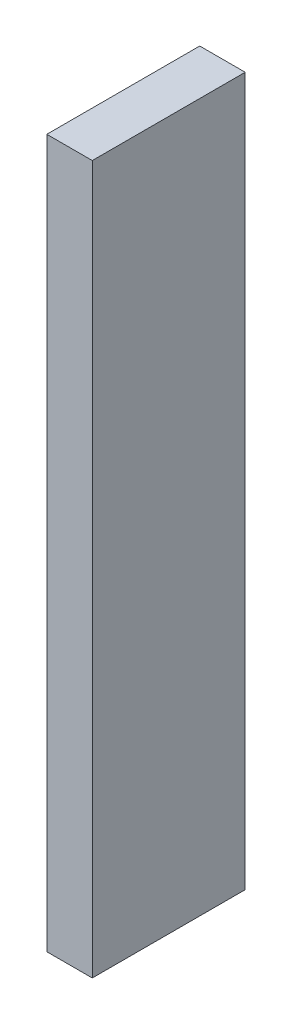
ISO-10303-21;
HEADER;
FILE_DESCRIPTION(('STEP AP214'),'2;1');
FILE_NAME('part.step','',(''),(''),'','','');
FILE_SCHEMA(('AUTOMOTIVE_DESIGN { 1 0 10303 214 1 1 1 1 }'));
ENDSEC;
DATA;
#1=APPLICATION_CONTEXT('core data for automotive mechanical design processes');
#2=APPLICATION_PROTOCOL_DEFINITION('international standard','automotive_design',2000,#1);
#3=PRODUCT_CONTEXT('',#1,'mechanical');
#4=PRODUCT('Part','Part','',(#3));
#5=PRODUCT_RELATED_PRODUCT_CATEGORY('part','',(#4));
#6=PRODUCT_DEFINITION_FORMATION('','',#4);
#7=PRODUCT_DEFINITION_CONTEXT('part definition',#1,'design');
#8=PRODUCT_DEFINITION('design','',#6,#7);
#9=PRODUCT_DEFINITION_SHAPE('','',#8);
#10=(LENGTH_UNIT() NAMED_UNIT(*) SI_UNIT(.MILLI.,.METRE.));
#11=(NAMED_UNIT(*) PLANE_ANGLE_UNIT() SI_UNIT($,.RADIAN.));
#12=(NAMED_UNIT(*) SI_UNIT($,.STERADIAN.) SOLID_ANGLE_UNIT());
#13=UNCERTAINTY_MEASURE_WITH_UNIT(LENGTH_MEASURE(1.E-05),#10,'distance_accuracy_value','');
#14=(GEOMETRIC_REPRESENTATION_CONTEXT(3) GLOBAL_UNCERTAINTY_ASSIGNED_CONTEXT((#13)) GLOBAL_UNIT_ASSIGNED_CONTEXT((#10,
#11,#12)) REPRESENTATION_CONTEXT('',''));
#15=CARTESIAN_POINT('',(0.,0.,0.));
#16=DIRECTION('',(0.,0.,1.));
#17=DIRECTION('',(1.,0.,0.));
#18=AXIS2_PLACEMENT_3D('',#15,#16,#17);
#19=CARTESIAN_POINT('',(130.275545195554,22.4180708263693,96.0720244776067));
#20=DIRECTION('',(-1.69244514382854E-09,0.,1.));
#21=DIRECTION('',(1.,0.,1.69244514382854E-09));
#22=AXIS2_PLACEMENT_3D('',#19,#20,#21);
#23=PLANE('',#22);
#24=DIRECTION('',(0.,-1.,0.));
#25=VECTOR('',#24,1.);
#26=CARTESIAN_POINT('',(131.258630292567,22.4180708263693,96.0720244792705));
#27=LINE('',#26,#25);
#28=CARTESIAN_POINT('',(131.258630292567,22.4180708263693,96.0720244792705));
#29=VERTEX_POINT('',#28);
#30=CARTESIAN_POINT('',(131.258630292567,7.11212965552236,96.0720244792705));
#31=VERTEX_POINT('',#30);
#32=EDGE_CURVE('E79',#29,#31,#27,.T.);
#33=ORIENTED_EDGE('',*,*,#32,.F.);
#34=DIRECTION('',(1.,0.,1.69244514382854E-09));
#35=VECTOR('',#34,1.);
#36=CARTESIAN_POINT('',(130.275545195554,22.4180708263693,96.0720244776067));
#37=LINE('',#36,#35);
#38=CARTESIAN_POINT('',(130.275545195554,22.4180708263693,96.0720244776067));
#39=VERTEX_POINT('',#38);
#40=EDGE_CURVE('E32',#39,#29,#37,.T.);
#41=ORIENTED_EDGE('',*,*,#40,.F.);
#42=DIRECTION('',(0.,-1.,0.));
#43=VECTOR('',#42,1.);
#44=CARTESIAN_POINT('',(130.275545195554,22.4180708263693,96.0720244776067));
#45=LINE('',#44,#43);
#46=CARTESIAN_POINT('',(130.275545195554,7.11212965552236,96.0720244776067));
#47=VERTEX_POINT('',#46);
#48=EDGE_CURVE('E71',#39,#47,#45,.T.);
#49=ORIENTED_EDGE('',*,*,#48,.T.);
#50=DIRECTION('',(1.,0.,1.69244514382854E-09));
#51=VECTOR('',#50,1.);
#52=CARTESIAN_POINT('',(130.275545195554,7.11212965552236,96.0720244776067));
#53=LINE('',#52,#51);
#54=EDGE_CURVE('E10',#47,#31,#53,.T.);
#55=ORIENTED_EDGE('',*,*,#54,.T.);
#56=EDGE_LOOP('',(#33,#41,#49,#55));
#57=FACE_BOUND('',#56,.T.);
#58=ADVANCED_FACE('F16',(#57),#23,.T.);
#59=CARTESIAN_POINT('',(130.275545195554,7.11212965552236,96.0720244776067));
#60=DIRECTION('',(0.,-1.,0.));
#61=DIRECTION('',(0.,0.,-1.));
#62=AXIS2_PLACEMENT_3D('',#59,#60,#61);
#63=PLANE('',#62);
#64=DIRECTION('',(1.69244514382854E-09,0.,-1.));
#65=VECTOR('',#64,1.);
#66=CARTESIAN_POINT('',(131.258630292567,7.11212965552236,96.0720244792705));
#67=LINE('',#66,#65);
#68=CARTESIAN_POINT('',(131.258630298163,7.11212965552235,92.7660833084218));
#69=VERTEX_POINT('',#68);
#70=EDGE_CURVE('E82',#31,#69,#67,.T.);
#71=ORIENTED_EDGE('',*,*,#70,.F.);
#72=ORIENTED_EDGE('',*,*,#54,.F.);
#73=DIRECTION('',(1.69244514382854E-09,0.,-1.));
#74=VECTOR('',#73,1.);
#75=CARTESIAN_POINT('',(130.275545195554,7.11212965552236,96.0720244776067));
#76=LINE('',#75,#74);
#77=CARTESIAN_POINT('',(130.27554520115,7.11212965552235,92.7660833067579));
#78=VERTEX_POINT('',#77);
#79=EDGE_CURVE('E67',#47,#78,#76,.T.);
#80=ORIENTED_EDGE('',*,*,#79,.T.);
#81=DIRECTION('',(1.,0.,1.69244514382854E-09));
#82=VECTOR('',#81,1.);
#83=CARTESIAN_POINT('',(130.27554520115,7.11212965552235,92.7660833067579));
#84=LINE('',#83,#82);
#85=EDGE_CURVE('E24',#78,#69,#84,.T.);
#86=ORIENTED_EDGE('',*,*,#85,.T.);
#87=EDGE_LOOP('',(#71,#72,#80,#86));
#88=FACE_BOUND('',#87,.T.);
#89=ADVANCED_FACE('F68',(#88),#63,.T.);
#90=CARTESIAN_POINT('',(130.27554520115,7.11212965552235,92.7660833067579));
#91=DIRECTION('',(1.69244514382854E-09,0.,-1.));
#92=DIRECTION('',(-1.,0.,-1.69244514382854E-09));
#93=AXIS2_PLACEMENT_3D('',#90,#91,#92);
#94=PLANE('',#93);
#95=DIRECTION('',(0.,1.,0.));
#96=VECTOR('',#95,1.);
#97=CARTESIAN_POINT('',(131.258630298163,7.11212965552235,92.7660833084218));
#98=LINE('',#97,#96);
#99=CARTESIAN_POINT('',(131.258630298163,22.418070826371,92.7660832999612));
#100=VERTEX_POINT('',#99);
#101=EDGE_CURVE('E65',#69,#100,#98,.T.);
#102=ORIENTED_EDGE('',*,*,#101,.F.);
#103=ORIENTED_EDGE('',*,*,#85,.F.);
#104=DIRECTION('',(0.,1.,0.));
#105=VECTOR('',#104,1.);
#106=CARTESIAN_POINT('',(130.27554520115,7.11212965552235,92.7660833067579));
#107=LINE('',#106,#105);
#108=CARTESIAN_POINT('',(130.27554520115,22.418070826371,92.7660832982974));
#109=VERTEX_POINT('',#108);
#110=EDGE_CURVE('E62',#78,#109,#107,.T.);
#111=ORIENTED_EDGE('',*,*,#110,.T.);
#112=DIRECTION('',(1.,0.,1.69244514382854E-09));
#113=VECTOR('',#112,1.);
#114=CARTESIAN_POINT('',(130.27554520115,22.418070826371,92.7660832982974));
#115=LINE('',#114,#113);
#116=EDGE_CURVE('E48',#109,#100,#115,.T.);
#117=ORIENTED_EDGE('',*,*,#116,.T.);
#118=EDGE_LOOP('',(#102,#103,#111,#117));
#119=FACE_BOUND('',#118,.T.);
#120=ADVANCED_FACE('F60',(#119),#94,.T.);
#121=CARTESIAN_POINT('',(130.27554520115,22.418070826371,92.7660832982974));
#122=DIRECTION('',(0.,1.,0.));
#123=DIRECTION('',(-1.,0.,0.));
#124=AXIS2_PLACEMENT_3D('',#121,#122,#123);
#125=PLANE('',#124);
#126=DIRECTION('',(-1.69244514382854E-09,0.,1.));
#127=VECTOR('',#126,1.);
#128=CARTESIAN_POINT('',(131.258630298163,22.418070826371,92.7660832999612));
#129=LINE('',#128,#127);
#130=EDGE_CURVE('E85',#100,#29,#129,.T.);
#131=ORIENTED_EDGE('',*,*,#130,.F.);
#132=ORIENTED_EDGE('',*,*,#116,.F.);
#133=DIRECTION('',(-1.69244514382854E-09,0.,1.));
#134=VECTOR('',#133,1.);
#135=CARTESIAN_POINT('',(130.27554520115,22.418070826371,92.7660832982974));
#136=LINE('',#135,#134);
#137=EDGE_CURVE('E74',#109,#39,#136,.T.);
#138=ORIENTED_EDGE('',*,*,#137,.T.);
#139=ORIENTED_EDGE('',*,*,#40,.T.);
#140=EDGE_LOOP('',(#131,#132,#138,#139));
#141=FACE_BOUND('',#140,.T.);
#142=ADVANCED_FACE('F96',(#141),#125,.T.);
#143=CARTESIAN_POINT('',(130.275545201028,17.2651002409467,92.8378607087388));
#144=DIRECTION('',(1.,0.,1.69244514382854E-09));
#145=DIRECTION('',(0.,1.,0.));
#146=AXIS2_PLACEMENT_3D('',#143,#144,#145);
#147=PLANE('',#146);
#148=ORIENTED_EDGE('',*,*,#48,.F.);
#149=ORIENTED_EDGE('',*,*,#137,.F.);
#150=ORIENTED_EDGE('',*,*,#110,.F.);
#151=ORIENTED_EDGE('',*,*,#79,.F.);
#152=EDGE_LOOP('',(#148,#149,#150,#151));
#153=FACE_BOUND('',#152,.T.);
#154=ADVANCED_FACE('F73',(#153),#147,.F.);
#155=CARTESIAN_POINT('',(131.258630298041,17.2651002409467,92.8378607104026));
#156=DIRECTION('',(1.,0.,1.69244514382854E-09));
#157=DIRECTION('',(0.,1.,0.));
#158=AXIS2_PLACEMENT_3D('',#155,#156,#157);
#159=PLANE('',#158);
#160=ORIENTED_EDGE('',*,*,#32,.T.);
#161=ORIENTED_EDGE('',*,*,#70,.T.);
#162=ORIENTED_EDGE('',*,*,#101,.T.);
#163=ORIENTED_EDGE('',*,*,#130,.T.);
#164=EDGE_LOOP('',(#160,#161,#162,#163));
#165=FACE_BOUND('',#164,.T.);
#166=ADVANCED_FACE('F89',(#165),#159,.T.);
#167=CLOSED_SHELL('',(#58,#89,#120,#142,#154,#166));
#168=MANIFOLD_SOLID_BREP('B1',#167);
#169=ADVANCED_BREP_SHAPE_REPRESENTATION('',(#18,#168),#14);
#170=SHAPE_DEFINITION_REPRESENTATION(#9,#169);
ENDSEC;
END-ISO-10303-21;
